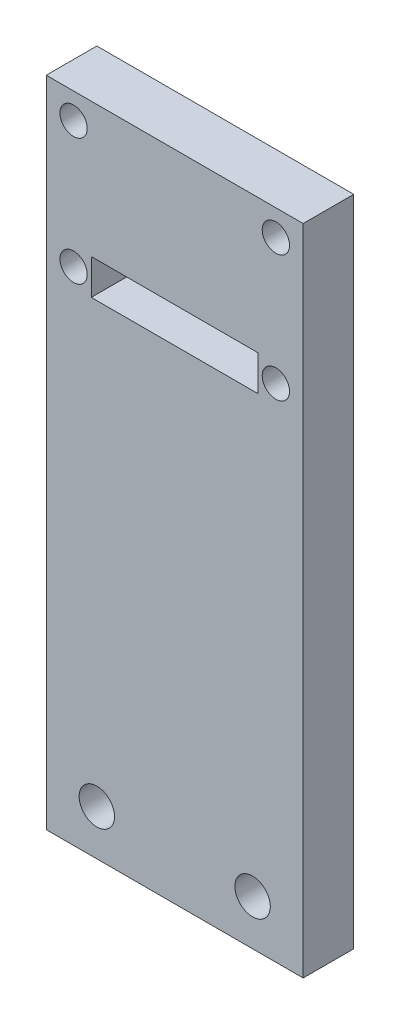
ISO-10303-21;
HEADER;
FILE_DESCRIPTION(('STEP AP214'),'2;1');
FILE_NAME('part.step','',(''),(''),'','','');
FILE_SCHEMA(('AUTOMOTIVE_DESIGN { 1 0 10303 214 1 1 1 1 }'));
ENDSEC;
DATA;
#1=APPLICATION_CONTEXT('core data for automotive mechanical design processes');
#2=APPLICATION_PROTOCOL_DEFINITION('international standard','automotive_design',2000,#1);
#3=PRODUCT_CONTEXT('',#1,'mechanical');
#4=PRODUCT('Part','Part','',(#3));
#5=PRODUCT_RELATED_PRODUCT_CATEGORY('part','',(#4));
#6=PRODUCT_DEFINITION_FORMATION('','',#4);
#7=PRODUCT_DEFINITION_CONTEXT('part definition',#1,'design');
#8=PRODUCT_DEFINITION('design','',#6,#7);
#9=PRODUCT_DEFINITION_SHAPE('','',#8);
#10=(LENGTH_UNIT() NAMED_UNIT(*) SI_UNIT(.MILLI.,.METRE.));
#11=(NAMED_UNIT(*) PLANE_ANGLE_UNIT() SI_UNIT($,.RADIAN.));
#12=(NAMED_UNIT(*) SI_UNIT($,.STERADIAN.) SOLID_ANGLE_UNIT());
#13=UNCERTAINTY_MEASURE_WITH_UNIT(LENGTH_MEASURE(1.E-05),#10,'distance_accuracy_value','');
#14=(GEOMETRIC_REPRESENTATION_CONTEXT(3) GLOBAL_UNCERTAINTY_ASSIGNED_CONTEXT((#13)) GLOBAL_UNIT_ASSIGNED_CONTEXT((#10,
#11,#12)) REPRESENTATION_CONTEXT('',''));
#15=CARTESIAN_POINT('',(0.,0.,0.));
#16=DIRECTION('',(0.,0.,1.));
#17=DIRECTION('',(1.,0.,0.));
#18=AXIS2_PLACEMENT_3D('',#15,#16,#17);
#19=CARTESIAN_POINT('',(-12.7,90.,-5.));
#20=DIRECTION('',(-1.,0.,0.));
#21=DIRECTION('',(0.,-1.,0.));
#22=AXIS2_PLACEMENT_3D('',#19,#20,#21);
#23=PLANE('',#22);
#24=DIRECTION('',(0.,-1.,0.));
#25=VECTOR('',#24,1.);
#26=CARTESIAN_POINT('',(-12.7,90.,0.));
#27=LINE('',#26,#25);
#28=CARTESIAN_POINT('',(-12.7,154.6,0.));
#29=VERTEX_POINT('',#28);
#30=CARTESIAN_POINT('',(-12.7,90.,0.));
#31=VERTEX_POINT('',#30);
#32=EDGE_CURVE('E155',#29,#31,#27,.T.);
#33=ORIENTED_EDGE('',*,*,#32,.F.);
#34=DIRECTION('',(0.,0.,1.));
#35=VECTOR('',#34,1.);
#36=CARTESIAN_POINT('',(-12.7,154.6,-5.));
#37=LINE('',#36,#35);
#38=CARTESIAN_POINT('',(-12.7,154.6,-5.));
#39=VERTEX_POINT('',#38);
#40=EDGE_CURVE('E11',#39,#29,#37,.T.);
#41=ORIENTED_EDGE('',*,*,#40,.F.);
#42=DIRECTION('',(0.,-1.,0.));
#43=VECTOR('',#42,1.);
#44=CARTESIAN_POINT('',(-12.7,90.,-5.));
#45=LINE('',#44,#43);
#46=CARTESIAN_POINT('',(-12.7,90.,-5.));
#47=VERTEX_POINT('',#46);
#48=EDGE_CURVE('E158',#39,#47,#45,.T.);
#49=ORIENTED_EDGE('',*,*,#48,.T.);
#50=DIRECTION('',(0.,0.,1.));
#51=VECTOR('',#50,1.);
#52=CARTESIAN_POINT('',(-12.7,90.,-5.));
#53=LINE('',#52,#51);
#54=EDGE_CURVE('E36',#47,#31,#53,.T.);
#55=ORIENTED_EDGE('',*,*,#54,.T.);
#56=EDGE_LOOP('',(#33,#41,#49,#55));
#57=FACE_BOUND('',#56,.T.);
#58=ADVANCED_FACE('F33',(#57),#23,.T.);
#59=CARTESIAN_POINT('',(12.7,154.6,-5.));
#60=DIRECTION('',(0.,1.,0.));
#61=DIRECTION('',(0.,0.,1.));
#62=AXIS2_PLACEMENT_3D('',#59,#60,#61);
#63=PLANE('',#62);
#64=DIRECTION('',(-1.,0.,0.));
#65=VECTOR('',#64,1.);
#66=CARTESIAN_POINT('',(12.7,154.6,0.));
#67=LINE('',#66,#65);
#68=CARTESIAN_POINT('',(12.7,154.6,0.));
#69=VERTEX_POINT('',#68);
#70=EDGE_CURVE('E162',#69,#29,#67,.T.);
#71=ORIENTED_EDGE('',*,*,#70,.F.);
#72=DIRECTION('',(0.,0.,1.));
#73=VECTOR('',#72,1.);
#74=CARTESIAN_POINT('',(12.7,154.6,-5.));
#75=LINE('',#74,#73);
#76=CARTESIAN_POINT('',(12.7,154.6,-5.));
#77=VERTEX_POINT('',#76);
#78=EDGE_CURVE('E41',#77,#69,#75,.T.);
#79=ORIENTED_EDGE('',*,*,#78,.F.);
#80=DIRECTION('',(-1.,0.,0.));
#81=VECTOR('',#80,1.);
#82=CARTESIAN_POINT('',(12.7,154.6,-5.));
#83=LINE('',#82,#81);
#84=EDGE_CURVE('E168',#77,#39,#83,.T.);
#85=ORIENTED_EDGE('',*,*,#84,.T.);
#86=ORIENTED_EDGE('',*,*,#40,.T.);
#87=EDGE_LOOP('',(#71,#79,#85,#86));
#88=FACE_BOUND('',#87,.T.);
#89=ADVANCED_FACE('F193',(#88),#63,.T.);
#90=CARTESIAN_POINT('',(12.7,90.,-5.));
#91=DIRECTION('',(1.,0.,0.));
#92=DIRECTION('',(0.,1.,0.));
#93=AXIS2_PLACEMENT_3D('',#90,#91,#92);
#94=PLANE('',#93);
#95=DIRECTION('',(0.,1.,0.));
#96=VECTOR('',#95,1.);
#97=CARTESIAN_POINT('',(12.7,90.,0.));
#98=LINE('',#97,#96);
#99=CARTESIAN_POINT('',(12.7,90.,0.));
#100=VERTEX_POINT('',#99);
#101=EDGE_CURVE('E176',#100,#69,#98,.T.);
#102=ORIENTED_EDGE('',*,*,#101,.F.);
#103=DIRECTION('',(0.,0.,1.));
#104=VECTOR('',#103,1.);
#105=CARTESIAN_POINT('',(12.7,90.,-5.));
#106=LINE('',#105,#104);
#107=CARTESIAN_POINT('',(12.7,90.,-5.));
#108=VERTEX_POINT('',#107);
#109=EDGE_CURVE('E181',#108,#100,#106,.T.);
#110=ORIENTED_EDGE('',*,*,#109,.F.);
#111=DIRECTION('',(0.,1.,0.));
#112=VECTOR('',#111,1.);
#113=CARTESIAN_POINT('',(12.7,90.,-5.));
#114=LINE('',#113,#112);
#115=EDGE_CURVE('E165',#108,#77,#114,.T.);
#116=ORIENTED_EDGE('',*,*,#115,.T.);
#117=ORIENTED_EDGE('',*,*,#78,.T.);
#118=EDGE_LOOP('',(#102,#110,#116,#117));
#119=FACE_BOUND('',#118,.T.);
#120=ADVANCED_FACE('F199',(#119),#94,.T.);
#121=CARTESIAN_POINT('',(-12.7,90.,-5.));
#122=DIRECTION('',(0.,-1.,0.));
#123=DIRECTION('',(0.,0.,-1.));
#124=AXIS2_PLACEMENT_3D('',#121,#122,#123);
#125=PLANE('',#124);
#126=DIRECTION('',(1.,0.,0.));
#127=VECTOR('',#126,1.);
#128=CARTESIAN_POINT('',(-12.7,90.,0.));
#129=LINE('',#128,#127);
#130=EDGE_CURVE('E173',#31,#100,#129,.T.);
#131=ORIENTED_EDGE('',*,*,#130,.F.);
#132=ORIENTED_EDGE('',*,*,#54,.F.);
#133=DIRECTION('',(1.,0.,0.));
#134=VECTOR('',#133,1.);
#135=CARTESIAN_POINT('',(-12.7,90.,-5.));
#136=LINE('',#135,#134);
#137=EDGE_CURVE('E161',#47,#108,#136,.T.);
#138=ORIENTED_EDGE('',*,*,#137,.T.);
#139=ORIENTED_EDGE('',*,*,#109,.T.);
#140=EDGE_LOOP('',(#131,#132,#138,#139));
#141=FACE_BOUND('',#140,.T.);
#142=ADVANCED_FACE('F189',(#141),#125,.T.);
#143=CARTESIAN_POINT('',(0.,0.,-5.));
#144=DIRECTION('',(0.,0.,1.));
#145=DIRECTION('',(1.,0.,0.));
#146=AXIS2_PLACEMENT_3D('',#143,#144,#145);
#147=PLANE('',#146);
#148=CARTESIAN_POINT('',(-7.7,94.4822296795939,-5.));
#149=DIRECTION('',(0.,0.,1.));
#150=DIRECTION('',(1.,0.,0.));
#151=AXIS2_PLACEMENT_3D('',#148,#149,#150);
#152=CIRCLE('',#151,1.75);
#153=CARTESIAN_POINT('',(-5.95,94.4822296795939,-5.));
#154=VERTEX_POINT('',#153);
#155=EDGE_CURVE('E129',#154,#154,#152,.T.);
#156=ORIENTED_EDGE('',*,*,#155,.T.);
#157=EDGE_LOOP('',(#156));
#158=FACE_BOUND('',#157,.T.);
#159=CARTESIAN_POINT('',(7.7,94.4822296795939,-5.));
#160=DIRECTION('',(0.,0.,1.));
#161=DIRECTION('',(-1.,0.,0.));
#162=AXIS2_PLACEMENT_3D('',#159,#160,#161);
#163=CIRCLE('',#162,1.75);
#164=CARTESIAN_POINT('',(5.95,94.4822296795939,-5.));
#165=VERTEX_POINT('',#164);
#166=EDGE_CURVE('E347',#165,#165,#163,.T.);
#167=ORIENTED_EDGE('',*,*,#166,.T.);
#168=EDGE_LOOP('',(#167));
#169=FACE_BOUND('',#168,.T.);
#170=CARTESIAN_POINT('',(-10.,152.05,-5.));
#171=DIRECTION('',(0.,0.,-1.));
#172=DIRECTION('',(-1.,0.,0.));
#173=AXIS2_PLACEMENT_3D('',#170,#171,#172);
#174=CIRCLE('',#173,1.35);
#175=CARTESIAN_POINT('',(-11.35,152.05,-5.));
#176=VERTEX_POINT('',#175);
#177=EDGE_CURVE('E142',#176,#176,#174,.T.);
#178=ORIENTED_EDGE('',*,*,#177,.F.);
#179=EDGE_LOOP('',(#178));
#180=FACE_BOUND('',#179,.T.);
#181=CARTESIAN_POINT('',(9.99999999999999,139.55,-5.));
#182=DIRECTION('',(0.,0.,-1.));
#183=DIRECTION('',(-1.,0.,0.));
#184=AXIS2_PLACEMENT_3D('',#181,#182,#183);
#185=CIRCLE('',#184,1.35);
#186=CARTESIAN_POINT('',(8.65,139.55,-5.));
#187=VERTEX_POINT('',#186);
#188=EDGE_CURVE('E148',#187,#187,#185,.T.);
#189=ORIENTED_EDGE('',*,*,#188,.F.);
#190=EDGE_LOOP('',(#189));
#191=FACE_BOUND('',#190,.T.);
#192=CARTESIAN_POINT('',(-10.,139.55,-5.));
#193=DIRECTION('',(0.,0.,-1.));
#194=DIRECTION('',(-1.,0.,0.));
#195=AXIS2_PLACEMENT_3D('',#192,#193,#194);
#196=CIRCLE('',#195,1.35);
#197=CARTESIAN_POINT('',(-11.35,139.55,-5.));
#198=VERTEX_POINT('',#197);
#199=EDGE_CURVE('E122',#198,#198,#196,.T.);
#200=ORIENTED_EDGE('',*,*,#199,.F.);
#201=EDGE_LOOP('',(#200));
#202=FACE_BOUND('',#201,.T.);
#203=DIRECTION('',(-1.,0.,0.));
#204=VECTOR('',#203,1.);
#205=CARTESIAN_POINT('',(8.25,137.8,-5.));
#206=LINE('',#205,#204);
#207=CARTESIAN_POINT('',(8.25,137.8,-5.));
#208=VERTEX_POINT('',#207);
#209=CARTESIAN_POINT('',(-8.25,137.8,-5.));
#210=VERTEX_POINT('',#209);
#211=EDGE_CURVE('E128',#208,#210,#206,.T.);
#212=ORIENTED_EDGE('',*,*,#211,.F.);
#213=DIRECTION('',(0.,-1.,0.));
#214=VECTOR('',#213,1.);
#215=CARTESIAN_POINT('',(8.25,141.3,-5.));
#216=LINE('',#215,#214);
#217=CARTESIAN_POINT('',(8.25,141.3,-5.));
#218=VERTEX_POINT('',#217);
#219=EDGE_CURVE('E49',#218,#208,#216,.T.);
#220=ORIENTED_EDGE('',*,*,#219,.F.);
#221=DIRECTION('',(1.,0.,0.));
#222=VECTOR('',#221,1.);
#223=CARTESIAN_POINT('',(8.25,141.3,-5.));
#224=LINE('',#223,#222);
#225=CARTESIAN_POINT('',(-8.25,141.3,-5.));
#226=VERTEX_POINT('',#225);
#227=EDGE_CURVE('E116',#226,#218,#224,.T.);
#228=ORIENTED_EDGE('',*,*,#227,.F.);
#229=DIRECTION('',(0.,1.,0.));
#230=VECTOR('',#229,1.);
#231=CARTESIAN_POINT('',(-8.25,141.3,-5.));
#232=LINE('',#231,#230);
#233=EDGE_CURVE('E119',#210,#226,#232,.T.);
#234=ORIENTED_EDGE('',*,*,#233,.F.);
#235=EDGE_LOOP('',(#212,#220,#228,#234));
#236=FACE_BOUND('',#235,.T.);
#237=CARTESIAN_POINT('',(9.99999999999999,152.05,-5.));
#238=DIRECTION('',(0.,0.,-1.));
#239=DIRECTION('',(-1.,0.,0.));
#240=AXIS2_PLACEMENT_3D('',#237,#238,#239);
#241=CIRCLE('',#240,1.35);
#242=CARTESIAN_POINT('',(8.65,152.05,-5.));
#243=VERTEX_POINT('',#242);
#244=EDGE_CURVE('E141',#243,#243,#241,.T.);
#245=ORIENTED_EDGE('',*,*,#244,.F.);
#246=EDGE_LOOP('',(#245));
#247=FACE_BOUND('',#246,.T.);
#248=ORIENTED_EDGE('',*,*,#48,.F.);
#249=ORIENTED_EDGE('',*,*,#84,.F.);
#250=ORIENTED_EDGE('',*,*,#115,.F.);
#251=ORIENTED_EDGE('',*,*,#137,.F.);
#252=EDGE_LOOP('',(#248,#249,#250,#251));
#253=FACE_BOUND('',#252,.T.);
#254=ADVANCED_FACE('F196',(#158,#169,#180,#191,#202,#236,#247,#253),#147,.F.);
#255=CARTESIAN_POINT('',(0.,0.,0.));
#256=DIRECTION('',(0.,0.,1.));
#257=DIRECTION('',(1.,0.,0.));
#258=AXIS2_PLACEMENT_3D('',#255,#256,#257);
#259=PLANE('',#258);
#260=CARTESIAN_POINT('',(-7.7,94.4822296795939,0.));
#261=DIRECTION('',(0.,0.,1.));
#262=DIRECTION('',(1.,0.,0.));
#263=AXIS2_PLACEMENT_3D('',#260,#261,#262);
#264=CIRCLE('',#263,1.75);
#265=CARTESIAN_POINT('',(-5.95,94.4822296795939,0.));
#266=VERTEX_POINT('',#265);
#267=EDGE_CURVE('E346',#266,#266,#264,.T.);
#268=ORIENTED_EDGE('',*,*,#267,.F.);
#269=EDGE_LOOP('',(#268));
#270=FACE_BOUND('',#269,.T.);
#271=CARTESIAN_POINT('',(7.7,94.4822296795939,0.));
#272=DIRECTION('',(0.,0.,1.));
#273=DIRECTION('',(-1.,0.,0.));
#274=AXIS2_PLACEMENT_3D('',#271,#272,#273);
#275=CIRCLE('',#274,1.75);
#276=CARTESIAN_POINT('',(5.95,94.4822296795939,0.));
#277=VERTEX_POINT('',#276);
#278=EDGE_CURVE('E351',#277,#277,#275,.T.);
#279=ORIENTED_EDGE('',*,*,#278,.F.);
#280=EDGE_LOOP('',(#279));
#281=FACE_BOUND('',#280,.T.);
#282=CARTESIAN_POINT('',(-10.,152.05,0.));
#283=DIRECTION('',(0.,0.,-1.));
#284=DIRECTION('',(-1.,0.,0.));
#285=AXIS2_PLACEMENT_3D('',#282,#283,#284);
#286=CIRCLE('',#285,1.35);
#287=CARTESIAN_POINT('',(-11.35,152.05,0.));
#288=VERTEX_POINT('',#287);
#289=EDGE_CURVE('E138',#288,#288,#286,.T.);
#290=ORIENTED_EDGE('',*,*,#289,.T.);
#291=EDGE_LOOP('',(#290));
#292=FACE_BOUND('',#291,.T.);
#293=CARTESIAN_POINT('',(9.99999999999999,139.55,0.));
#294=DIRECTION('',(0.,0.,-1.));
#295=DIRECTION('',(-1.,0.,0.));
#296=AXIS2_PLACEMENT_3D('',#293,#294,#295);
#297=CIRCLE('',#296,1.35);
#298=CARTESIAN_POINT('',(8.65,139.55,0.));
#299=VERTEX_POINT('',#298);
#300=EDGE_CURVE('E145',#299,#299,#297,.T.);
#301=ORIENTED_EDGE('',*,*,#300,.T.);
#302=EDGE_LOOP('',(#301));
#303=FACE_BOUND('',#302,.T.);
#304=CARTESIAN_POINT('',(-10.,139.55,0.));
#305=DIRECTION('',(0.,0.,-1.));
#306=DIRECTION('',(-1.,0.,0.));
#307=AXIS2_PLACEMENT_3D('',#304,#305,#306);
#308=CIRCLE('',#307,1.35);
#309=CARTESIAN_POINT('',(-11.35,139.55,0.));
#310=VERTEX_POINT('',#309);
#311=EDGE_CURVE('E151',#310,#310,#308,.T.);
#312=ORIENTED_EDGE('',*,*,#311,.T.);
#313=EDGE_LOOP('',(#312));
#314=FACE_BOUND('',#313,.T.);
#315=DIRECTION('',(0.,-1.,0.));
#316=VECTOR('',#315,1.);
#317=CARTESIAN_POINT('',(8.25,141.3,0.));
#318=LINE('',#317,#316);
#319=CARTESIAN_POINT('',(8.25,141.3,0.));
#320=VERTEX_POINT('',#319);
#321=CARTESIAN_POINT('',(8.25,137.8,0.));
#322=VERTEX_POINT('',#321);
#323=EDGE_CURVE('E100',#320,#322,#318,.T.);
#324=ORIENTED_EDGE('',*,*,#323,.T.);
#325=DIRECTION('',(-1.,0.,0.));
#326=VECTOR('',#325,1.);
#327=CARTESIAN_POINT('',(8.25,137.8,0.));
#328=LINE('',#327,#326);
#329=CARTESIAN_POINT('',(-8.25,137.8,0.));
#330=VERTEX_POINT('',#329);
#331=EDGE_CURVE('E109',#322,#330,#328,.T.);
#332=ORIENTED_EDGE('',*,*,#331,.T.);
#333=DIRECTION('',(0.,1.,0.));
#334=VECTOR('',#333,1.);
#335=CARTESIAN_POINT('',(-8.25,141.3,0.));
#336=LINE('',#335,#334);
#337=CARTESIAN_POINT('',(-8.25,141.3,0.));
#338=VERTEX_POINT('',#337);
#339=EDGE_CURVE('E57',#330,#338,#336,.T.);
#340=ORIENTED_EDGE('',*,*,#339,.T.);
#341=DIRECTION('',(1.,0.,0.));
#342=VECTOR('',#341,1.);
#343=CARTESIAN_POINT('',(8.25,141.3,0.));
#344=LINE('',#343,#342);
#345=EDGE_CURVE('E106',#338,#320,#344,.T.);
#346=ORIENTED_EDGE('',*,*,#345,.T.);
#347=EDGE_LOOP('',(#324,#332,#340,#346));
#348=FACE_BOUND('',#347,.T.);
#349=CARTESIAN_POINT('',(9.99999999999999,152.05,0.));
#350=DIRECTION('',(0.,0.,-1.));
#351=DIRECTION('',(-1.,0.,0.));
#352=AXIS2_PLACEMENT_3D('',#349,#350,#351);
#353=CIRCLE('',#352,1.35);
#354=CARTESIAN_POINT('',(8.65,152.05,0.));
#355=VERTEX_POINT('',#354);
#356=EDGE_CURVE('E152',#355,#355,#353,.T.);
#357=ORIENTED_EDGE('',*,*,#356,.T.);
#358=EDGE_LOOP('',(#357));
#359=FACE_BOUND('',#358,.T.);
#360=ORIENTED_EDGE('',*,*,#32,.T.);
#361=ORIENTED_EDGE('',*,*,#130,.T.);
#362=ORIENTED_EDGE('',*,*,#101,.T.);
#363=ORIENTED_EDGE('',*,*,#70,.T.);
#364=EDGE_LOOP('',(#360,#361,#362,#363));
#365=FACE_BOUND('',#364,.T.);
#366=ADVANCED_FACE('F113',(#270,#281,#292,#303,#314,#348,#359,#365),#259,.T.);
#367=CARTESIAN_POINT('',(9.99999999999999,152.05,0.));
#368=DIRECTION('',(0.,0.,-1.));
#369=DIRECTION('',(-1.,0.,0.));
#370=AXIS2_PLACEMENT_3D('',#367,#368,#369);
#371=CYLINDRICAL_SURFACE('',#370,1.35);
#372=ORIENTED_EDGE('',*,*,#356,.F.);
#373=EDGE_LOOP('',(#372));
#374=FACE_BOUND('',#373,.T.);
#375=ORIENTED_EDGE('',*,*,#244,.T.);
#376=EDGE_LOOP('',(#375));
#377=FACE_BOUND('',#376,.T.);
#378=ADVANCED_FACE('F231',(#374,#377),#371,.F.);
#379=CARTESIAN_POINT('',(8.25,141.3,0.));
#380=DIRECTION('',(1.,0.,0.));
#381=DIRECTION('',(0.,0.,-1.));
#382=AXIS2_PLACEMENT_3D('',#379,#380,#381);
#383=PLANE('',#382);
#384=ORIENTED_EDGE('',*,*,#219,.T.);
#385=DIRECTION('',(0.,0.,-1.));
#386=VECTOR('',#385,1.);
#387=CARTESIAN_POINT('',(8.25,137.8,0.));
#388=LINE('',#387,#386);
#389=EDGE_CURVE('E96',#322,#208,#388,.T.);
#390=ORIENTED_EDGE('',*,*,#389,.F.);
#391=ORIENTED_EDGE('',*,*,#323,.F.);
#392=DIRECTION('',(0.,0.,-1.));
#393=VECTOR('',#392,1.);
#394=CARTESIAN_POINT('',(8.25,141.3,0.));
#395=LINE('',#394,#393);
#396=EDGE_CURVE('E133',#320,#218,#395,.T.);
#397=ORIENTED_EDGE('',*,*,#396,.T.);
#398=EDGE_LOOP('',(#384,#390,#391,#397));
#399=FACE_BOUND('',#398,.T.);
#400=ADVANCED_FACE('F98',(#399),#383,.F.);
#401=CARTESIAN_POINT('',(8.25,141.3,0.));
#402=DIRECTION('',(0.,1.,0.));
#403=DIRECTION('',(0.,0.,1.));
#404=AXIS2_PLACEMENT_3D('',#401,#402,#403);
#405=PLANE('',#404);
#406=ORIENTED_EDGE('',*,*,#227,.T.);
#407=ORIENTED_EDGE('',*,*,#396,.F.);
#408=ORIENTED_EDGE('',*,*,#345,.F.);
#409=DIRECTION('',(0.,0.,-1.));
#410=VECTOR('',#409,1.);
#411=CARTESIAN_POINT('',(-8.25,141.3,0.));
#412=LINE('',#411,#410);
#413=EDGE_CURVE('E135',#338,#226,#412,.T.);
#414=ORIENTED_EDGE('',*,*,#413,.T.);
#415=EDGE_LOOP('',(#406,#407,#408,#414));
#416=FACE_BOUND('',#415,.T.);
#417=ADVANCED_FACE('F247',(#416),#405,.F.);
#418=CARTESIAN_POINT('',(-8.25,141.3,0.));
#419=DIRECTION('',(-1.,0.,0.));
#420=DIRECTION('',(0.,0.,1.));
#421=AXIS2_PLACEMENT_3D('',#418,#419,#420);
#422=PLANE('',#421);
#423=ORIENTED_EDGE('',*,*,#233,.T.);
#424=ORIENTED_EDGE('',*,*,#413,.F.);
#425=ORIENTED_EDGE('',*,*,#339,.F.);
#426=DIRECTION('',(0.,0.,-1.));
#427=VECTOR('',#426,1.);
#428=CARTESIAN_POINT('',(-8.25,137.8,0.));
#429=LINE('',#428,#427);
#430=EDGE_CURVE('E105',#330,#210,#429,.T.);
#431=ORIENTED_EDGE('',*,*,#430,.T.);
#432=EDGE_LOOP('',(#423,#424,#425,#431));
#433=FACE_BOUND('',#432,.T.);
#434=ADVANCED_FACE('F256',(#433),#422,.F.);
#435=CARTESIAN_POINT('',(8.25,137.8,0.));
#436=DIRECTION('',(0.,-1.,0.));
#437=DIRECTION('',(0.,0.,-1.));
#438=AXIS2_PLACEMENT_3D('',#435,#436,#437);
#439=PLANE('',#438);
#440=ORIENTED_EDGE('',*,*,#211,.T.);
#441=ORIENTED_EDGE('',*,*,#430,.F.);
#442=ORIENTED_EDGE('',*,*,#331,.F.);
#443=ORIENTED_EDGE('',*,*,#389,.T.);
#444=EDGE_LOOP('',(#440,#441,#442,#443));
#445=FACE_BOUND('',#444,.T.);
#446=ADVANCED_FACE('F110',(#445),#439,.F.);
#447=CARTESIAN_POINT('',(-10.,139.55,0.));
#448=DIRECTION('',(0.,0.,-1.));
#449=DIRECTION('',(-1.,0.,0.));
#450=AXIS2_PLACEMENT_3D('',#447,#448,#449);
#451=CYLINDRICAL_SURFACE('',#450,1.35);
#452=ORIENTED_EDGE('',*,*,#311,.F.);
#453=EDGE_LOOP('',(#452));
#454=FACE_BOUND('',#453,.T.);
#455=ORIENTED_EDGE('',*,*,#199,.T.);
#456=EDGE_LOOP('',(#455));
#457=FACE_BOUND('',#456,.T.);
#458=ADVANCED_FACE('F274',(#454,#457),#451,.F.);
#459=CARTESIAN_POINT('',(9.99999999999999,139.55,0.));
#460=DIRECTION('',(0.,0.,-1.));
#461=DIRECTION('',(-1.,0.,0.));
#462=AXIS2_PLACEMENT_3D('',#459,#460,#461);
#463=CYLINDRICAL_SURFACE('',#462,1.35);
#464=ORIENTED_EDGE('',*,*,#300,.F.);
#465=EDGE_LOOP('',(#464));
#466=FACE_BOUND('',#465,.T.);
#467=ORIENTED_EDGE('',*,*,#188,.T.);
#468=EDGE_LOOP('',(#467));
#469=FACE_BOUND('',#468,.T.);
#470=ADVANCED_FACE('F283',(#466,#469),#463,.F.);
#471=CARTESIAN_POINT('',(-10.,152.05,0.));
#472=DIRECTION('',(0.,0.,-1.));
#473=DIRECTION('',(-1.,0.,0.));
#474=AXIS2_PLACEMENT_3D('',#471,#472,#473);
#475=CYLINDRICAL_SURFACE('',#474,1.35);
#476=ORIENTED_EDGE('',*,*,#289,.F.);
#477=EDGE_LOOP('',(#476));
#478=FACE_BOUND('',#477,.T.);
#479=ORIENTED_EDGE('',*,*,#177,.T.);
#480=EDGE_LOOP('',(#479));
#481=FACE_BOUND('',#480,.T.);
#482=ADVANCED_FACE('F293',(#478,#481),#475,.F.);
#483=CARTESIAN_POINT('',(7.7,94.4822296795939,-5.));
#484=DIRECTION('',(0.,0.,1.));
#485=DIRECTION('',(1.,0.,0.));
#486=AXIS2_PLACEMENT_3D('',#483,#484,#485);
#487=CYLINDRICAL_SURFACE('',#486,1.75);
#488=ORIENTED_EDGE('',*,*,#166,.F.);
#489=EDGE_LOOP('',(#488));
#490=FACE_BOUND('',#489,.T.);
#491=ORIENTED_EDGE('',*,*,#278,.T.);
#492=EDGE_LOOP('',(#491));
#493=FACE_BOUND('',#492,.T.);
#494=ADVANCED_FACE('F303',(#490,#493),#487,.F.);
#495=CARTESIAN_POINT('',(-7.7,94.4822296795939,-5.));
#496=DIRECTION('',(0.,0.,1.));
#497=DIRECTION('',(1.,0.,0.));
#498=AXIS2_PLACEMENT_3D('',#495,#496,#497);
#499=CYLINDRICAL_SURFACE('',#498,1.75);
#500=ORIENTED_EDGE('',*,*,#155,.F.);
#501=EDGE_LOOP('',(#500));
#502=FACE_BOUND('',#501,.T.);
#503=ORIENTED_EDGE('',*,*,#267,.T.);
#504=EDGE_LOOP('',(#503));
#505=FACE_BOUND('',#504,.T.);
#506=ADVANCED_FACE('F327',(#502,#505),#499,.F.);
#507=CLOSED_SHELL('',(#58,#89,#120,#142,#254,#366,#378,#400,#417,#434,#446,#458,#470,#482,#494,#506));
#508=MANIFOLD_SOLID_BREP('B2',#507);
#509=ADVANCED_BREP_SHAPE_REPRESENTATION('',(#18,#508),#14);
#510=SHAPE_DEFINITION_REPRESENTATION(#9,#509);
ENDSEC;
END-ISO-10303-21;
